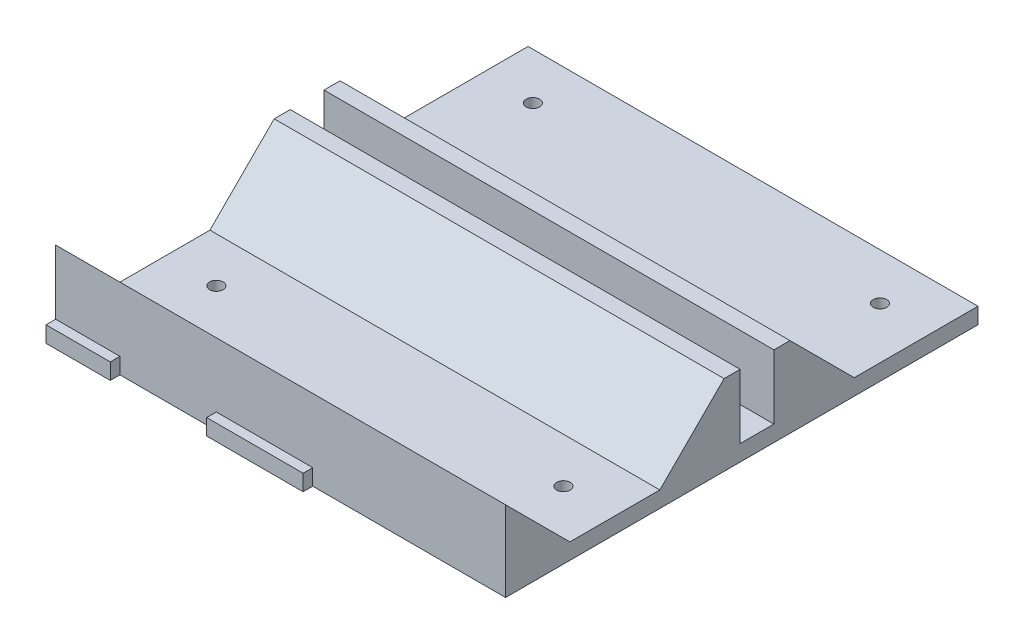
ISO-10303-21;
HEADER;
FILE_DESCRIPTION(('STEP AP214'),'2;1');
FILE_NAME('part.step','',(''),(''),'','','');
FILE_SCHEMA(('AUTOMOTIVE_DESIGN { 1 0 10303 214 1 1 1 1 }'));
ENDSEC;
DATA;
#1=APPLICATION_CONTEXT('core data for automotive mechanical design processes');
#2=APPLICATION_PROTOCOL_DEFINITION('international standard','automotive_design',2000,#1);
#3=PRODUCT_CONTEXT('',#1,'mechanical');
#4=PRODUCT('Part','Part','',(#3));
#5=PRODUCT_RELATED_PRODUCT_CATEGORY('part','',(#4));
#6=PRODUCT_DEFINITION_FORMATION('','',#4);
#7=PRODUCT_DEFINITION_CONTEXT('part definition',#1,'design');
#8=PRODUCT_DEFINITION('design','',#6,#7);
#9=PRODUCT_DEFINITION_SHAPE('','',#8);
#10=(LENGTH_UNIT() NAMED_UNIT(*) SI_UNIT(.MILLI.,.METRE.));
#11=(NAMED_UNIT(*) PLANE_ANGLE_UNIT() SI_UNIT($,.RADIAN.));
#12=(NAMED_UNIT(*) SI_UNIT($,.STERADIAN.) SOLID_ANGLE_UNIT());
#13=UNCERTAINTY_MEASURE_WITH_UNIT(LENGTH_MEASURE(1.E-05),#10,'distance_accuracy_value','');
#14=(GEOMETRIC_REPRESENTATION_CONTEXT(3) GLOBAL_UNCERTAINTY_ASSIGNED_CONTEXT((#13)) GLOBAL_UNIT_ASSIGNED_CONTEXT((#10,
#11,#12)) REPRESENTATION_CONTEXT('',''));
#15=CARTESIAN_POINT('',(0.,0.,0.));
#16=DIRECTION('',(0.,0.,1.));
#17=DIRECTION('',(1.,0.,0.));
#18=AXIS2_PLACEMENT_3D('',#15,#16,#17);
#19=CARTESIAN_POINT('',(150.,205.01,0.));
#20=DIRECTION('',(0.,0.,1.));
#21=DIRECTION('',(1.,0.,0.));
#22=AXIS2_PLACEMENT_3D('',#19,#20,#21);
#23=PLANE('',#22);
#24=DIRECTION('',(1.,0.,0.));
#25=VECTOR('',#24,1.);
#26=CARTESIAN_POINT('',(0.,5.,0.));
#27=LINE('',#26,#25);
#28=CARTESIAN_POINT('',(10.0000000000002,5.,0.));
#29=VERTEX_POINT('',#28);
#30=CARTESIAN_POINT('',(150.,5.,0.));
#31=VERTEX_POINT('',#30);
#32=EDGE_CURVE('E47',#29,#31,#27,.T.);
#33=ORIENTED_EDGE('',*,*,#32,.T.);
#34=DIRECTION('',(0.,-1.,0.));
#35=VECTOR('',#34,1.);
#36=CARTESIAN_POINT('',(150.,5.,0.));
#37=LINE('',#36,#35);
#38=CARTESIAN_POINT('',(150.,0.,0.));
#39=VERTEX_POINT('',#38);
#40=EDGE_CURVE('E333',#31,#39,#37,.T.);
#41=ORIENTED_EDGE('',*,*,#40,.T.);
#42=DIRECTION('',(1.,0.,0.));
#43=VECTOR('',#42,1.);
#44=CARTESIAN_POINT('',(0.,0.,0.));
#45=LINE('',#44,#43);
#46=CARTESIAN_POINT('',(10.0000000000002,0.,0.));
#47=VERTEX_POINT('',#46);
#48=EDGE_CURVE('E326',#47,#39,#45,.T.);
#49=ORIENTED_EDGE('',*,*,#48,.F.);
#50=DIRECTION('',(0.,1.,0.));
#51=VECTOR('',#50,1.);
#52=CARTESIAN_POINT('',(10.0000000000002,205.01,0.));
#53=LINE('',#52,#51);
#54=EDGE_CURVE('E11',#47,#29,#53,.T.);
#55=ORIENTED_EDGE('',*,*,#54,.T.);
#56=EDGE_LOOP('',(#33,#41,#49,#55));
#57=FACE_BOUND('',#56,.T.);
#58=ADVANCED_FACE('F44',(#57),#23,.F.);
#59=CARTESIAN_POINT('',(10.0000000000001,205.01,150.));
#60=DIRECTION('',(-1.,0.,0.));
#61=DIRECTION('',(0.,0.,1.));
#62=AXIS2_PLACEMENT_3D('',#59,#60,#61);
#63=PLANE('',#62);
#64=DIRECTION('',(0.,0.,1.));
#65=VECTOR('',#64,1.);
#66=CARTESIAN_POINT('',(10.0000000000002,5.,0.));
#67=LINE('',#66,#65);
#68=CARTESIAN_POINT('',(10.0000000000001,5.,38.4999999999998));
#69=VERTEX_POINT('',#68);
#70=EDGE_CURVE('E343',#29,#69,#67,.T.);
#71=ORIENTED_EDGE('',*,*,#70,.F.);
#72=ORIENTED_EDGE('',*,*,#54,.F.);
#73=DIRECTION('',(0.,0.,1.));
#74=VECTOR('',#73,1.);
#75=CARTESIAN_POINT('',(10.0000000000002,0.,0.));
#76=LINE('',#75,#74);
#77=CARTESIAN_POINT('',(10.0000000000001,0.,150.));
#78=VERTEX_POINT('',#77);
#79=EDGE_CURVE('E330',#47,#78,#76,.T.);
#80=ORIENTED_EDGE('',*,*,#79,.T.);
#81=DIRECTION('',(0.,1.,0.));
#82=VECTOR('',#81,1.);
#83=CARTESIAN_POINT('',(10.0000000000001,5.,150.));
#84=LINE('',#83,#82);
#85=CARTESIAN_POINT('',(10.0000000000001,5.,150.));
#86=VERTEX_POINT('',#85);
#87=EDGE_CURVE('E322',#78,#86,#84,.T.);
#88=ORIENTED_EDGE('',*,*,#87,.T.);
#89=DIRECTION('',(0.,0.,1.));
#90=VECTOR('',#89,1.);
#91=CARTESIAN_POINT('',(10.0000000000002,5.,0.));
#92=LINE('',#91,#90);
#93=CARTESIAN_POINT('',(10.0000000000001,5.,147.));
#94=VERTEX_POINT('',#93);
#95=EDGE_CURVE('E339',#94,#86,#92,.T.);
#96=ORIENTED_EDGE('',*,*,#95,.F.);
#97=DIRECTION('',(0.,-1.,0.));
#98=VECTOR('',#97,1.);
#99=CARTESIAN_POINT('',(10.0000000000001,5.,147.));
#100=LINE('',#99,#98);
#101=CARTESIAN_POINT('',(10.0000000000001,25.,147.));
#102=VERTEX_POINT('',#101);
#103=EDGE_CURVE('E337',#102,#94,#100,.T.);
#104=ORIENTED_EDGE('',*,*,#103,.F.);
#105=DIRECTION('',(0.,-0.707106781186552,-0.707106781186543));
#106=VECTOR('',#105,1.);
#107=CARTESIAN_POINT('',(10.0000000000001,5.00000000000015,127.000000000001));
#108=LINE('',#107,#106);
#109=CARTESIAN_POINT('',(10.0000000000001,5.,127.));
#110=VERTEX_POINT('',#109);
#111=EDGE_CURVE('E52',#102,#110,#108,.T.);
#112=ORIENTED_EDGE('',*,*,#111,.T.);
#113=DIRECTION('',(0.,0.,1.));
#114=VECTOR('',#113,1.);
#115=CARTESIAN_POINT('',(10.0000000000002,5.,0.));
#116=LINE('',#115,#114);
#117=CARTESIAN_POINT('',(10.0000000000002,5.,99.0000000000004));
#118=VERTEX_POINT('',#117);
#119=EDGE_CURVE('E344',#118,#110,#116,.T.);
#120=ORIENTED_EDGE('',*,*,#119,.F.);
#121=DIRECTION('',(0.,0.707106781186544,-0.707106781186551));
#122=VECTOR('',#121,1.);
#123=CARTESIAN_POINT('',(10.0000000000002,5.,99.0000000000004));
#124=LINE('',#123,#122);
#125=CARTESIAN_POINT('',(10.0000000000002,25.,79.0000000000002));
#126=VERTEX_POINT('',#125);
#127=EDGE_CURVE('E346',#118,#126,#124,.T.);
#128=ORIENTED_EDGE('',*,*,#127,.T.);
#129=DIRECTION('',(0.,0.,1.));
#130=VECTOR('',#129,1.);
#131=CARTESIAN_POINT('',(10.0000000000002,25.,0.));
#132=LINE('',#131,#130);
#133=CARTESIAN_POINT('',(10.0000000000002,25.,74.));
#134=VERTEX_POINT('',#133);
#135=EDGE_CURVE('E320',#134,#126,#132,.T.);
#136=ORIENTED_EDGE('',*,*,#135,.F.);
#137=DIRECTION('',(0.,1.,0.));
#138=VECTOR('',#137,1.);
#139=CARTESIAN_POINT('',(10.0000000000002,25.,74.));
#140=LINE('',#139,#138);
#141=CARTESIAN_POINT('',(10.0000000000002,5.,74.));
#142=VERTEX_POINT('',#141);
#143=EDGE_CURVE('E329',#142,#134,#140,.T.);
#144=ORIENTED_EDGE('',*,*,#143,.F.);
#145=DIRECTION('',(0.,0.,1.));
#146=VECTOR('',#145,1.);
#147=CARTESIAN_POINT('',(10.0000000000002,5.,0.));
#148=LINE('',#147,#146);
#149=CARTESIAN_POINT('',(10.0000000000002,5.,63.5));
#150=VERTEX_POINT('',#149);
#151=EDGE_CURVE('E328',#150,#142,#148,.T.);
#152=ORIENTED_EDGE('',*,*,#151,.F.);
#153=DIRECTION('',(0.,1.,0.));
#154=VECTOR('',#153,1.);
#155=CARTESIAN_POINT('',(10.0000000000002,25.,63.5));
#156=LINE('',#155,#154);
#157=CARTESIAN_POINT('',(10.0000000000002,25.,63.5));
#158=VERTEX_POINT('',#157);
#159=EDGE_CURVE('E325',#150,#158,#156,.T.);
#160=ORIENTED_EDGE('',*,*,#159,.T.);
#161=DIRECTION('',(0.,0.,1.));
#162=VECTOR('',#161,1.);
#163=CARTESIAN_POINT('',(10.0000000000002,25.,0.));
#164=LINE('',#163,#162);
#165=CARTESIAN_POINT('',(10.0000000000002,25.,58.4999999999996));
#166=VERTEX_POINT('',#165);
#167=EDGE_CURVE('E340',#166,#158,#164,.T.);
#168=ORIENTED_EDGE('',*,*,#167,.F.);
#169=DIRECTION('',(0.,0.707106781186551,0.707106781186544));
#170=VECTOR('',#169,1.);
#171=CARTESIAN_POINT('',(10.0000000000002,27.0000000000004,60.5));
#172=LINE('',#171,#170);
#173=EDGE_CURVE('E335',#166,#69,#172,.F.);
#174=ORIENTED_EDGE('',*,*,#173,.T.);
#175=EDGE_LOOP('',(#71,#72,#80,#88,#96,#104,#112,#120,#128,#136,#144,#152,#160,#168,#174));
#176=FACE_BOUND('',#175,.T.);
#177=ADVANCED_FACE('F369',(#176),#63,.T.);
#178=CARTESIAN_POINT('',(0.,5.,0.));
#179=DIRECTION('',(0.,1.,0.));
#180=DIRECTION('',(0.,0.,1.));
#181=AXIS2_PLACEMENT_3D('',#178,#179,#180);
#182=PLANE('',#181);
#183=CARTESIAN_POINT('',(26.0000000000002,5.,113.));
#184=DIRECTION('',(0.,1.,0.));
#185=DIRECTION('',(0.,0.,1.));
#186=AXIS2_PLACEMENT_3D('',#183,#184,#185);
#187=CIRCLE('',#186,2.1);
#188=CARTESIAN_POINT('',(26.0000000000002,5.,115.1));
#189=VERTEX_POINT('',#188);
#190=EDGE_CURVE('E420',#189,#189,#187,.T.);
#191=ORIENTED_EDGE('',*,*,#190,.F.);
#192=EDGE_LOOP('',(#191));
#193=FACE_BOUND('',#192,.T.);
#194=CARTESIAN_POINT('',(134.,5.,113.));
#195=DIRECTION('',(0.,1.,0.));
#196=DIRECTION('',(0.,0.,1.));
#197=AXIS2_PLACEMENT_3D('',#194,#195,#196);
#198=CIRCLE('',#197,2.09999999999999);
#199=CARTESIAN_POINT('',(134.,5.,115.1));
#200=VERTEX_POINT('',#199);
#201=EDGE_CURVE('E397',#200,#200,#198,.T.);
#202=ORIENTED_EDGE('',*,*,#201,.F.);
#203=EDGE_LOOP('',(#202));
#204=FACE_BOUND('',#203,.T.);
#205=DIRECTION('',(-1.,0.,0.));
#206=VECTOR('',#205,1.);
#207=CARTESIAN_POINT('',(0.,5.,99.0000000000004));
#208=LINE('',#207,#206);
#209=CARTESIAN_POINT('',(150.,5.,99.0000000000004));
#210=VERTEX_POINT('',#209);
#211=EDGE_CURVE('E304',#210,#118,#208,.T.);
#212=ORIENTED_EDGE('',*,*,#211,.T.);
#213=ORIENTED_EDGE('',*,*,#119,.T.);
#214=DIRECTION('',(-1.,0.,0.));
#215=VECTOR('',#214,1.);
#216=CARTESIAN_POINT('',(150.,5.,127.000000000001));
#217=LINE('',#216,#215);
#218=CARTESIAN_POINT('',(150.,5.,127.));
#219=VERTEX_POINT('',#218);
#220=EDGE_CURVE('E68',#219,#110,#217,.T.);
#221=ORIENTED_EDGE('',*,*,#220,.F.);
#222=DIRECTION('',(0.,0.,1.));
#223=VECTOR('',#222,1.);
#224=CARTESIAN_POINT('',(150.,5.,0.));
#225=LINE('',#224,#223);
#226=EDGE_CURVE('E197',#210,#219,#225,.T.);
#227=ORIENTED_EDGE('',*,*,#226,.F.);
#228=EDGE_LOOP('',(#212,#213,#221,#227));
#229=FACE_BOUND('',#228,.T.);
#230=ADVANCED_FACE('F441',(#193,#204,#229),#182,.T.);
#231=CARTESIAN_POINT('',(0.,5.,99.0000000000004));
#232=DIRECTION('',(0.,-0.707106781186551,-0.707106781186544));
#233=DIRECTION('',(-1.,0.,0.));
#234=AXIS2_PLACEMENT_3D('',#231,#232,#233);
#235=PLANE('',#234);
#236=ORIENTED_EDGE('',*,*,#127,.F.);
#237=ORIENTED_EDGE('',*,*,#211,.F.);
#238=DIRECTION('',(0.,-0.707106781186544,0.707106781186551));
#239=VECTOR('',#238,1.);
#240=CARTESIAN_POINT('',(150.,5.,99.0000000000004));
#241=LINE('',#240,#239);
#242=CARTESIAN_POINT('',(150.,25.,79.0000000000002));
#243=VERTEX_POINT('',#242);
#244=EDGE_CURVE('E317',#243,#210,#241,.T.);
#245=ORIENTED_EDGE('',*,*,#244,.F.);
#246=DIRECTION('',(1.,0.,0.));
#247=VECTOR('',#246,1.);
#248=CARTESIAN_POINT('',(0.,25.,79.0000000000002));
#249=LINE('',#248,#247);
#250=EDGE_CURVE('E314',#126,#243,#249,.T.);
#251=ORIENTED_EDGE('',*,*,#250,.F.);
#252=EDGE_LOOP('',(#236,#237,#245,#251));
#253=FACE_BOUND('',#252,.T.);
#254=ADVANCED_FACE('F444',(#253),#235,.F.);
#255=CARTESIAN_POINT('',(134.,5.,14.4999999999998));
#256=DIRECTION('',(0.,1.,0.));
#257=DIRECTION('',(0.,0.,1.));
#258=AXIS2_PLACEMENT_3D('',#255,#256,#257);
#259=CIRCLE('',#258,2.09999999999999);
#260=CARTESIAN_POINT('',(134.,5.,16.5999999999998));
#261=VERTEX_POINT('',#260);
#262=EDGE_CURVE('E405',#261,#261,#259,.T.);
#263=ORIENTED_EDGE('',*,*,#262,.F.);
#264=EDGE_LOOP('',(#263));
#265=FACE_BOUND('',#264,.T.);
#266=CARTESIAN_POINT('',(26.0000000000002,5.,14.4999999999998));
#267=DIRECTION('',(0.,1.,0.));
#268=DIRECTION('',(0.,0.,1.));
#269=AXIS2_PLACEMENT_3D('',#266,#267,#268);
#270=CIRCLE('',#269,2.1);
#271=CARTESIAN_POINT('',(26.0000000000002,5.,16.5999999999998));
#272=VERTEX_POINT('',#271);
#273=EDGE_CURVE('E412',#272,#272,#270,.T.);
#274=ORIENTED_EDGE('',*,*,#273,.F.);
#275=EDGE_LOOP('',(#274));
#276=FACE_BOUND('',#275,.T.);
#277=ORIENTED_EDGE('',*,*,#32,.F.);
#278=ORIENTED_EDGE('',*,*,#70,.T.);
#279=DIRECTION('',(1.,0.,0.));
#280=VECTOR('',#279,1.);
#281=CARTESIAN_POINT('',(150.,5.,38.4999999999998));
#282=LINE('',#281,#280);
#283=CARTESIAN_POINT('',(150.,5.,38.4999999999998));
#284=VERTEX_POINT('',#283);
#285=EDGE_CURVE('E190',#69,#284,#282,.T.);
#286=ORIENTED_EDGE('',*,*,#285,.T.);
#287=EDGE_CURVE('E191',#31,#284,#225,.T.);
#288=ORIENTED_EDGE('',*,*,#287,.F.);
#289=EDGE_LOOP('',(#277,#278,#286,#288));
#290=FACE_BOUND('',#289,.T.);
#291=ADVANCED_FACE('F363',(#265,#276,#290),#182,.T.);
#292=DIRECTION('',(-1.,0.,0.));
#293=VECTOR('',#292,1.);
#294=CARTESIAN_POINT('',(150.,5.,147.000000000001));
#295=LINE('',#294,#293);
#296=CARTESIAN_POINT('',(30.,5.,147.));
#297=VERTEX_POINT('',#296);
#298=EDGE_CURVE('E212',#297,#94,#295,.T.);
#299=ORIENTED_EDGE('',*,*,#298,.T.);
#300=ORIENTED_EDGE('',*,*,#95,.T.);
#301=DIRECTION('',(1.,0.,0.));
#302=VECTOR('',#301,1.);
#303=CARTESIAN_POINT('',(0.,5.,150.));
#304=LINE('',#303,#302);
#305=CARTESIAN_POINT('',(30.,5.,150.));
#306=VERTEX_POINT('',#305);
#307=EDGE_CURVE('E245',#86,#306,#304,.T.);
#308=ORIENTED_EDGE('',*,*,#307,.T.);
#309=DIRECTION('',(0.,0.,-1.));
#310=VECTOR('',#309,1.);
#311=CARTESIAN_POINT('',(30.,5.,150.));
#312=LINE('',#311,#310);
#313=EDGE_CURVE('E248',#306,#297,#312,.T.);
#314=ORIENTED_EDGE('',*,*,#313,.T.);
#315=EDGE_LOOP('',(#299,#300,#308,#314));
#316=FACE_BOUND('',#315,.T.);
#317=ADVANCED_FACE('F386',(#316),#182,.T.);
#318=CARTESIAN_POINT('',(0.,5.,147.));
#319=DIRECTION('',(0.,0.,1.));
#320=DIRECTION('',(1.,0.,0.));
#321=AXIS2_PLACEMENT_3D('',#318,#319,#320);
#322=PLANE('',#321);
#323=DIRECTION('',(-1.,0.,0.));
#324=VECTOR('',#323,1.);
#325=CARTESIAN_POINT('',(150.,25.,147.000000000001));
#326=LINE('',#325,#324);
#327=CARTESIAN_POINT('',(150.,25.,147.000000000001));
#328=VERTEX_POINT('',#327);
#329=EDGE_CURVE('E60',#328,#102,#326,.T.);
#330=ORIENTED_EDGE('',*,*,#329,.T.);
#331=ORIENTED_EDGE('',*,*,#103,.T.);
#332=ORIENTED_EDGE('',*,*,#298,.F.);
#333=DIRECTION('',(0.,-1.,0.));
#334=VECTOR('',#333,1.);
#335=CARTESIAN_POINT('',(30.,5.,147.));
#336=LINE('',#335,#334);
#337=CARTESIAN_POINT('',(30.,0.,147.));
#338=VERTEX_POINT('',#337);
#339=EDGE_CURVE('E252',#297,#338,#336,.T.);
#340=ORIENTED_EDGE('',*,*,#339,.T.);
#341=DIRECTION('',(-1.,0.,0.));
#342=VECTOR('',#341,1.);
#343=CARTESIAN_POINT('',(0.,0.,147.));
#344=LINE('',#343,#342);
#345=CARTESIAN_POINT('',(60.,0.,147.));
#346=VERTEX_POINT('',#345);
#347=EDGE_CURVE('E292',#346,#338,#344,.T.);
#348=ORIENTED_EDGE('',*,*,#347,.F.);
#349=DIRECTION('',(0.,-1.,0.));
#350=VECTOR('',#349,1.);
#351=CARTESIAN_POINT('',(60.,5.,147.));
#352=LINE('',#351,#350);
#353=CARTESIAN_POINT('',(60.,5.,147.));
#354=VERTEX_POINT('',#353);
#355=EDGE_CURVE('E241',#354,#346,#352,.T.);
#356=ORIENTED_EDGE('',*,*,#355,.F.);
#357=CARTESIAN_POINT('',(90.,5.,147.));
#358=VERTEX_POINT('',#357);
#359=EDGE_CURVE('E205',#358,#354,#295,.T.);
#360=ORIENTED_EDGE('',*,*,#359,.F.);
#361=DIRECTION('',(0.,-1.,0.));
#362=VECTOR('',#361,1.);
#363=CARTESIAN_POINT('',(90.,5.,147.));
#364=LINE('',#363,#362);
#365=CARTESIAN_POINT('',(90.,0.,147.));
#366=VERTEX_POINT('',#365);
#367=EDGE_CURVE('E225',#358,#366,#364,.T.);
#368=ORIENTED_EDGE('',*,*,#367,.T.);
#369=CARTESIAN_POINT('',(150.,0.,147.));
#370=VERTEX_POINT('',#369);
#371=EDGE_CURVE('E186',#370,#366,#344,.T.);
#372=ORIENTED_EDGE('',*,*,#371,.F.);
#373=DIRECTION('',(0.,-1.,0.));
#374=VECTOR('',#373,1.);
#375=CARTESIAN_POINT('',(150.,5.,147.));
#376=LINE('',#375,#374);
#377=EDGE_CURVE('E181',#328,#370,#376,.T.);
#378=ORIENTED_EDGE('',*,*,#377,.F.);
#379=EDGE_LOOP('',(#330,#331,#332,#340,#348,#356,#360,#368,#372,#378));
#380=FACE_BOUND('',#379,.T.);
#381=ADVANCED_FACE('F183',(#380),#322,.T.);
#382=CARTESIAN_POINT('',(0.,25.,0.));
#383=DIRECTION('',(0.,1.,0.));
#384=DIRECTION('',(0.,0.,1.));
#385=AXIS2_PLACEMENT_3D('',#382,#383,#384);
#386=PLANE('',#385);
#387=DIRECTION('',(1.,0.,0.));
#388=VECTOR('',#387,1.);
#389=CARTESIAN_POINT('',(0.,25.,58.4999999999996));
#390=LINE('',#389,#388);
#391=CARTESIAN_POINT('',(150.,25.,58.4999999999996));
#392=VERTEX_POINT('',#391);
#393=EDGE_CURVE('E307',#392,#166,#390,.F.);
#394=ORIENTED_EDGE('',*,*,#393,.T.);
#395=ORIENTED_EDGE('',*,*,#167,.T.);
#396=DIRECTION('',(1.,0.,0.));
#397=VECTOR('',#396,1.);
#398=CARTESIAN_POINT('',(0.,25.,63.5));
#399=LINE('',#398,#397);
#400=CARTESIAN_POINT('',(150.,25.,63.5));
#401=VERTEX_POINT('',#400);
#402=EDGE_CURVE('E279',#158,#401,#399,.T.);
#403=ORIENTED_EDGE('',*,*,#402,.T.);
#404=DIRECTION('',(0.,0.,1.));
#405=VECTOR('',#404,1.);
#406=CARTESIAN_POINT('',(150.,25.,0.));
#407=LINE('',#406,#405);
#408=EDGE_CURVE('E282',#392,#401,#407,.T.);
#409=ORIENTED_EDGE('',*,*,#408,.F.);
#410=EDGE_LOOP('',(#394,#395,#403,#409));
#411=FACE_BOUND('',#410,.T.);
#412=ADVANCED_FACE('F473',(#411),#386,.T.);
#413=CARTESIAN_POINT('',(0.,27.0000000000004,60.5));
#414=DIRECTION('',(0.,0.707106781186544,-0.707106781186551));
#415=DIRECTION('',(1.,0.,0.));
#416=AXIS2_PLACEMENT_3D('',#413,#414,#415);
#417=PLANE('',#416);
#418=ORIENTED_EDGE('',*,*,#173,.F.);
#419=ORIENTED_EDGE('',*,*,#393,.F.);
#420=DIRECTION('',(0.,-0.707106781186551,-0.707106781186544));
#421=VECTOR('',#420,1.);
#422=CARTESIAN_POINT('',(150.,27.0000000000004,60.5));
#423=LINE('',#422,#421);
#424=EDGE_CURVE('E310',#284,#392,#423,.F.);
#425=ORIENTED_EDGE('',*,*,#424,.F.);
#426=ORIENTED_EDGE('',*,*,#285,.F.);
#427=EDGE_LOOP('',(#418,#419,#425,#426));
#428=FACE_BOUND('',#427,.T.);
#429=ADVANCED_FACE('F372',(#428),#417,.T.);
#430=DIRECTION('',(-1.,0.,0.));
#431=VECTOR('',#430,1.);
#432=CARTESIAN_POINT('',(0.,5.,63.5));
#433=LINE('',#432,#431);
#434=CARTESIAN_POINT('',(150.,5.,63.5));
#435=VERTEX_POINT('',#434);
#436=EDGE_CURVE('E289',#435,#150,#433,.T.);
#437=ORIENTED_EDGE('',*,*,#436,.T.);
#438=ORIENTED_EDGE('',*,*,#151,.T.);
#439=DIRECTION('',(-1.,0.,0.));
#440=VECTOR('',#439,1.);
#441=CARTESIAN_POINT('',(0.,5.,74.));
#442=LINE('',#441,#440);
#443=CARTESIAN_POINT('',(150.,5.,74.));
#444=VERTEX_POINT('',#443);
#445=EDGE_CURVE('E275',#444,#142,#442,.T.);
#446=ORIENTED_EDGE('',*,*,#445,.F.);
#447=EDGE_CURVE('E296',#435,#444,#225,.T.);
#448=ORIENTED_EDGE('',*,*,#447,.F.);
#449=EDGE_LOOP('',(#437,#438,#446,#448));
#450=FACE_BOUND('',#449,.T.);
#451=ADVANCED_FACE('F465',(#450),#182,.T.);
#452=CARTESIAN_POINT('',(0.,0.,0.));
#453=DIRECTION('',(0.,1.,0.));
#454=DIRECTION('',(0.,0.,1.));
#455=AXIS2_PLACEMENT_3D('',#452,#453,#454);
#456=PLANE('',#455);
#457=CARTESIAN_POINT('',(26.0000000000002,0.,14.4999999999998));
#458=DIRECTION('',(0.,1.,0.));
#459=DIRECTION('',(0.,0.,1.));
#460=AXIS2_PLACEMENT_3D('',#457,#458,#459);
#461=CIRCLE('',#460,2.1);
#462=CARTESIAN_POINT('',(26.0000000000002,0.,16.5999999999998));
#463=VERTEX_POINT('',#462);
#464=EDGE_CURVE('E401',#463,#463,#461,.T.);
#465=ORIENTED_EDGE('',*,*,#464,.T.);
#466=EDGE_LOOP('',(#465));
#467=FACE_BOUND('',#466,.T.);
#468=CARTESIAN_POINT('',(26.0000000000002,0.,113.));
#469=DIRECTION('',(0.,1.,0.));
#470=DIRECTION('',(0.,0.,1.));
#471=AXIS2_PLACEMENT_3D('',#468,#469,#470);
#472=CIRCLE('',#471,2.1);
#473=CARTESIAN_POINT('',(26.0000000000002,0.,115.1));
#474=VERTEX_POINT('',#473);
#475=EDGE_CURVE('E416',#474,#474,#472,.T.);
#476=ORIENTED_EDGE('',*,*,#475,.T.);
#477=EDGE_LOOP('',(#476));
#478=FACE_BOUND('',#477,.T.);
#479=CARTESIAN_POINT('',(134.,0.,14.4999999999998));
#480=DIRECTION('',(0.,1.,0.));
#481=DIRECTION('',(0.,0.,1.));
#482=AXIS2_PLACEMENT_3D('',#479,#480,#481);
#483=CIRCLE('',#482,2.09999999999999);
#484=CARTESIAN_POINT('',(134.,0.,16.5999999999998));
#485=VERTEX_POINT('',#484);
#486=EDGE_CURVE('E199',#485,#485,#483,.T.);
#487=ORIENTED_EDGE('',*,*,#486,.T.);
#488=EDGE_LOOP('',(#487));
#489=FACE_BOUND('',#488,.T.);
#490=CARTESIAN_POINT('',(134.,0.,113.));
#491=DIRECTION('',(0.,1.,0.));
#492=DIRECTION('',(0.,0.,1.));
#493=AXIS2_PLACEMENT_3D('',#490,#491,#492);
#494=CIRCLE('',#493,2.09999999999999);
#495=CARTESIAN_POINT('',(134.,0.,115.1));
#496=VERTEX_POINT('',#495);
#497=EDGE_CURVE('E400',#496,#496,#494,.T.);
#498=ORIENTED_EDGE('',*,*,#497,.T.);
#499=EDGE_LOOP('',(#498));
#500=FACE_BOUND('',#499,.T.);
#501=ORIENTED_EDGE('',*,*,#79,.F.);
#502=ORIENTED_EDGE('',*,*,#48,.T.);
#503=DIRECTION('',(0.,0.,1.));
#504=VECTOR('',#503,1.);
#505=CARTESIAN_POINT('',(150.,0.,0.));
#506=LINE('',#505,#504);
#507=EDGE_CURVE('E299',#39,#370,#506,.T.);
#508=ORIENTED_EDGE('',*,*,#507,.T.);
#509=ORIENTED_EDGE('',*,*,#371,.T.);
#510=DIRECTION('',(0.,0.,-1.));
#511=VECTOR('',#510,1.);
#512=CARTESIAN_POINT('',(90.,0.,150.));
#513=LINE('',#512,#511);
#514=CARTESIAN_POINT('',(90.,0.,150.));
#515=VERTEX_POINT('',#514);
#516=EDGE_CURVE('E220',#515,#366,#513,.T.);
#517=ORIENTED_EDGE('',*,*,#516,.F.);
#518=DIRECTION('',(1.,0.,0.));
#519=VECTOR('',#518,1.);
#520=CARTESIAN_POINT('',(60.,0.,150.));
#521=LINE('',#520,#519);
#522=CARTESIAN_POINT('',(60.,0.,150.));
#523=VERTEX_POINT('',#522);
#524=EDGE_CURVE('E209',#523,#515,#521,.T.);
#525=ORIENTED_EDGE('',*,*,#524,.F.);
#526=DIRECTION('',(0.,0.,1.));
#527=VECTOR('',#526,1.);
#528=CARTESIAN_POINT('',(60.,0.,147.));
#529=LINE('',#528,#527);
#530=EDGE_CURVE('E204',#346,#523,#529,.T.);
#531=ORIENTED_EDGE('',*,*,#530,.F.);
#532=ORIENTED_EDGE('',*,*,#347,.T.);
#533=DIRECTION('',(0.,0.,-1.));
#534=VECTOR('',#533,1.);
#535=CARTESIAN_POINT('',(30.,0.,150.));
#536=LINE('',#535,#534);
#537=CARTESIAN_POINT('',(30.,0.,150.));
#538=VERTEX_POINT('',#537);
#539=EDGE_CURVE('E249',#538,#338,#536,.T.);
#540=ORIENTED_EDGE('',*,*,#539,.F.);
#541=DIRECTION('',(1.,0.,0.));
#542=VECTOR('',#541,1.);
#543=CARTESIAN_POINT('',(0.,0.,150.));
#544=LINE('',#543,#542);
#545=EDGE_CURVE('E244',#78,#538,#544,.T.);
#546=ORIENTED_EDGE('',*,*,#545,.F.);
#547=EDGE_LOOP('',(#501,#502,#508,#509,#517,#525,#531,#532,#540,#546));
#548=FACE_BOUND('',#547,.T.);
#549=ADVANCED_FACE('F430',(#467,#478,#489,#500,#548),#456,.F.);
#550=CARTESIAN_POINT('',(0.,25.,63.5));
#551=DIRECTION('',(0.,0.,-1.));
#552=DIRECTION('',(-1.,0.,0.));
#553=AXIS2_PLACEMENT_3D('',#550,#551,#552);
#554=PLANE('',#553);
#555=ORIENTED_EDGE('',*,*,#159,.F.);
#556=ORIENTED_EDGE('',*,*,#436,.F.);
#557=DIRECTION('',(0.,-1.,0.));
#558=VECTOR('',#557,1.);
#559=CARTESIAN_POINT('',(150.,25.,63.5));
#560=LINE('',#559,#558);
#561=EDGE_CURVE('E286',#401,#435,#560,.T.);
#562=ORIENTED_EDGE('',*,*,#561,.F.);
#563=ORIENTED_EDGE('',*,*,#402,.F.);
#564=EDGE_LOOP('',(#555,#556,#562,#563));
#565=FACE_BOUND('',#564,.T.);
#566=ADVANCED_FACE('F470',(#565),#554,.F.);
#567=CARTESIAN_POINT('',(0.,25.,74.));
#568=DIRECTION('',(0.,0.,-1.));
#569=DIRECTION('',(-1.,0.,0.));
#570=AXIS2_PLACEMENT_3D('',#567,#568,#569);
#571=PLANE('',#570);
#572=ORIENTED_EDGE('',*,*,#445,.T.);
#573=ORIENTED_EDGE('',*,*,#143,.T.);
#574=DIRECTION('',(1.,0.,0.));
#575=VECTOR('',#574,1.);
#576=CARTESIAN_POINT('',(0.,25.,74.));
#577=LINE('',#576,#575);
#578=CARTESIAN_POINT('',(150.,25.,74.));
#579=VERTEX_POINT('',#578);
#580=EDGE_CURVE('E269',#134,#579,#577,.T.);
#581=ORIENTED_EDGE('',*,*,#580,.T.);
#582=DIRECTION('',(0.,-1.,0.));
#583=VECTOR('',#582,1.);
#584=CARTESIAN_POINT('',(150.,25.,74.));
#585=LINE('',#584,#583);
#586=EDGE_CURVE('E272',#579,#444,#585,.T.);
#587=ORIENTED_EDGE('',*,*,#586,.T.);
#588=EDGE_LOOP('',(#572,#573,#581,#587));
#589=FACE_BOUND('',#588,.T.);
#590=ADVANCED_FACE('F463',(#589),#571,.T.);
#591=CARTESIAN_POINT('',(0.,25.,0.));
#592=DIRECTION('',(0.,1.,0.));
#593=DIRECTION('',(0.,0.,1.));
#594=AXIS2_PLACEMENT_3D('',#591,#592,#593);
#595=PLANE('',#594);
#596=ORIENTED_EDGE('',*,*,#580,.F.);
#597=ORIENTED_EDGE('',*,*,#135,.T.);
#598=ORIENTED_EDGE('',*,*,#250,.T.);
#599=DIRECTION('',(0.,0.,1.));
#600=VECTOR('',#599,1.);
#601=CARTESIAN_POINT('',(150.,25.,0.));
#602=LINE('',#601,#600);
#603=EDGE_CURVE('E265',#579,#243,#602,.T.);
#604=ORIENTED_EDGE('',*,*,#603,.F.);
#605=EDGE_LOOP('',(#596,#597,#598,#604));
#606=FACE_BOUND('',#605,.T.);
#607=ADVANCED_FACE('F457',(#606),#595,.T.);
#608=CARTESIAN_POINT('',(0.,5.,150.));
#609=DIRECTION('',(0.,0.,-1.));
#610=DIRECTION('',(-1.,0.,0.));
#611=AXIS2_PLACEMENT_3D('',#608,#609,#610);
#612=PLANE('',#611);
#613=ORIENTED_EDGE('',*,*,#87,.F.);
#614=ORIENTED_EDGE('',*,*,#545,.T.);
#615=DIRECTION('',(0.,-1.,0.));
#616=VECTOR('',#615,1.);
#617=CARTESIAN_POINT('',(30.,5.,150.));
#618=LINE('',#617,#616);
#619=EDGE_CURVE('E261',#306,#538,#618,.T.);
#620=ORIENTED_EDGE('',*,*,#619,.F.);
#621=ORIENTED_EDGE('',*,*,#307,.F.);
#622=EDGE_LOOP('',(#613,#614,#620,#621));
#623=FACE_BOUND('',#622,.T.);
#624=ADVANCED_FACE('F381',(#623),#612,.F.);
#625=CARTESIAN_POINT('',(150.,5.,127.000000000001));
#626=DIRECTION('',(0.,-0.707106781186543,0.707106781186552));
#627=DIRECTION('',(0.,-0.707106781186552,-0.707106781186543));
#628=AXIS2_PLACEMENT_3D('',#625,#626,#627);
#629=PLANE('',#628);
#630=ORIENTED_EDGE('',*,*,#111,.F.);
#631=ORIENTED_EDGE('',*,*,#329,.F.);
#632=DIRECTION('',(0.,0.707106781186552,0.707106781186543));
#633=VECTOR('',#632,1.);
#634=CARTESIAN_POINT('',(150.,5.,127.000000000001));
#635=LINE('',#634,#633);
#636=EDGE_CURVE('E194',#219,#328,#635,.T.);
#637=ORIENTED_EDGE('',*,*,#636,.F.);
#638=ORIENTED_EDGE('',*,*,#220,.T.);
#639=EDGE_LOOP('',(#630,#631,#637,#638));
#640=FACE_BOUND('',#639,.T.);
#641=ADVANCED_FACE('F201',(#640),#629,.F.);
#642=DIRECTION('',(0.,0.,-1.));
#643=VECTOR('',#642,1.);
#644=CARTESIAN_POINT('',(90.,5.,150.));
#645=LINE('',#644,#643);
#646=CARTESIAN_POINT('',(90.,5.,150.));
#647=VERTEX_POINT('',#646);
#648=EDGE_CURVE('E223',#647,#358,#645,.T.);
#649=ORIENTED_EDGE('',*,*,#648,.T.);
#650=ORIENTED_EDGE('',*,*,#359,.T.);
#651=DIRECTION('',(0.,0.,1.));
#652=VECTOR('',#651,1.);
#653=CARTESIAN_POINT('',(60.,5.,147.));
#654=LINE('',#653,#652);
#655=CARTESIAN_POINT('',(60.,5.,150.));
#656=VERTEX_POINT('',#655);
#657=EDGE_CURVE('E216',#354,#656,#654,.T.);
#658=ORIENTED_EDGE('',*,*,#657,.T.);
#659=DIRECTION('',(1.,0.,0.));
#660=VECTOR('',#659,1.);
#661=CARTESIAN_POINT('',(60.,5.,150.));
#662=LINE('',#661,#660);
#663=EDGE_CURVE('E219',#656,#647,#662,.T.);
#664=ORIENTED_EDGE('',*,*,#663,.T.);
#665=EDGE_LOOP('',(#649,#650,#658,#664));
#666=FACE_BOUND('',#665,.T.);
#667=ADVANCED_FACE('F446',(#666),#182,.T.);
#668=CARTESIAN_POINT('',(150.,5.,0.));
#669=DIRECTION('',(1.,0.,0.));
#670=DIRECTION('',(0.,0.,-1.));
#671=AXIS2_PLACEMENT_3D('',#668,#669,#670);
#672=PLANE('',#671);
#673=ORIENTED_EDGE('',*,*,#40,.F.);
#674=ORIENTED_EDGE('',*,*,#287,.T.);
#675=ORIENTED_EDGE('',*,*,#424,.T.);
#676=ORIENTED_EDGE('',*,*,#408,.T.);
#677=ORIENTED_EDGE('',*,*,#561,.T.);
#678=ORIENTED_EDGE('',*,*,#447,.T.);
#679=ORIENTED_EDGE('',*,*,#586,.F.);
#680=ORIENTED_EDGE('',*,*,#603,.T.);
#681=ORIENTED_EDGE('',*,*,#244,.T.);
#682=ORIENTED_EDGE('',*,*,#226,.T.);
#683=ORIENTED_EDGE('',*,*,#636,.T.);
#684=ORIENTED_EDGE('',*,*,#377,.T.);
#685=ORIENTED_EDGE('',*,*,#507,.F.);
#686=EDGE_LOOP('',(#673,#674,#675,#676,#677,#678,#679,#680,#681,#682,#683,#684,#685));
#687=FACE_BOUND('',#686,.T.);
#688=ADVANCED_FACE('F195',(#687),#672,.T.);
#689=CARTESIAN_POINT('',(30.,5.,150.));
#690=DIRECTION('',(-1.,0.,0.));
#691=DIRECTION('',(0.,0.,1.));
#692=AXIS2_PLACEMENT_3D('',#689,#690,#691);
#693=PLANE('',#692);
#694=ORIENTED_EDGE('',*,*,#539,.T.);
#695=ORIENTED_EDGE('',*,*,#339,.F.);
#696=ORIENTED_EDGE('',*,*,#313,.F.);
#697=ORIENTED_EDGE('',*,*,#619,.T.);
#698=EDGE_LOOP('',(#694,#695,#696,#697));
#699=FACE_BOUND('',#698,.T.);
#700=ADVANCED_FACE('F519',(#699),#693,.F.);
#701=CARTESIAN_POINT('',(60.,5.,147.));
#702=DIRECTION('',(1.,0.,0.));
#703=DIRECTION('',(0.,0.,-1.));
#704=AXIS2_PLACEMENT_3D('',#701,#702,#703);
#705=PLANE('',#704);
#706=ORIENTED_EDGE('',*,*,#530,.T.);
#707=DIRECTION('',(0.,-1.,0.));
#708=VECTOR('',#707,1.);
#709=CARTESIAN_POINT('',(60.,5.,150.));
#710=LINE('',#709,#708);
#711=EDGE_CURVE('E237',#656,#523,#710,.T.);
#712=ORIENTED_EDGE('',*,*,#711,.F.);
#713=ORIENTED_EDGE('',*,*,#657,.F.);
#714=ORIENTED_EDGE('',*,*,#355,.T.);
#715=EDGE_LOOP('',(#706,#712,#713,#714));
#716=FACE_BOUND('',#715,.T.);
#717=ADVANCED_FACE('F515',(#716),#705,.F.);
#718=CARTESIAN_POINT('',(60.,5.,150.));
#719=DIRECTION('',(0.,0.,-1.));
#720=DIRECTION('',(-1.,0.,0.));
#721=AXIS2_PLACEMENT_3D('',#718,#719,#720);
#722=PLANE('',#721);
#723=ORIENTED_EDGE('',*,*,#524,.T.);
#724=DIRECTION('',(0.,-1.,0.));
#725=VECTOR('',#724,1.);
#726=CARTESIAN_POINT('',(90.,5.,150.));
#727=LINE('',#726,#725);
#728=EDGE_CURVE('E233',#647,#515,#727,.T.);
#729=ORIENTED_EDGE('',*,*,#728,.F.);
#730=ORIENTED_EDGE('',*,*,#663,.F.);
#731=ORIENTED_EDGE('',*,*,#711,.T.);
#732=EDGE_LOOP('',(#723,#729,#730,#731));
#733=FACE_BOUND('',#732,.T.);
#734=ADVANCED_FACE('F511',(#733),#722,.F.);
#735=CARTESIAN_POINT('',(90.,5.,150.));
#736=DIRECTION('',(-1.,0.,0.));
#737=DIRECTION('',(0.,0.,1.));
#738=AXIS2_PLACEMENT_3D('',#735,#736,#737);
#739=PLANE('',#738);
#740=ORIENTED_EDGE('',*,*,#516,.T.);
#741=ORIENTED_EDGE('',*,*,#367,.F.);
#742=ORIENTED_EDGE('',*,*,#648,.F.);
#743=ORIENTED_EDGE('',*,*,#728,.T.);
#744=EDGE_LOOP('',(#740,#741,#742,#743));
#745=FACE_BOUND('',#744,.T.);
#746=ADVANCED_FACE('F508',(#745),#739,.F.);
#747=CARTESIAN_POINT('',(26.0000000000002,0.,14.4999999999998));
#748=DIRECTION('',(0.,1.,0.));
#749=DIRECTION('',(0.,0.,1.));
#750=AXIS2_PLACEMENT_3D('',#747,#748,#749);
#751=CYLINDRICAL_SURFACE('',#750,2.1);
#752=ORIENTED_EDGE('',*,*,#464,.F.);
#753=EDGE_LOOP('',(#752));
#754=FACE_BOUND('',#753,.T.);
#755=ORIENTED_EDGE('',*,*,#273,.T.);
#756=EDGE_LOOP('',(#755));
#757=FACE_BOUND('',#756,.T.);
#758=ADVANCED_FACE('F437',(#754,#757),#751,.F.);
#759=CARTESIAN_POINT('',(26.0000000000002,0.,113.));
#760=DIRECTION('',(0.,1.,0.));
#761=DIRECTION('',(0.,0.,1.));
#762=AXIS2_PLACEMENT_3D('',#759,#760,#761);
#763=CYLINDRICAL_SURFACE('',#762,2.1);
#764=ORIENTED_EDGE('',*,*,#475,.F.);
#765=EDGE_LOOP('',(#764));
#766=FACE_BOUND('',#765,.T.);
#767=ORIENTED_EDGE('',*,*,#190,.T.);
#768=EDGE_LOOP('',(#767));
#769=FACE_BOUND('',#768,.T.);
#770=ADVANCED_FACE('F433',(#766,#769),#763,.F.);
#771=CARTESIAN_POINT('',(134.,0.,14.4999999999998));
#772=DIRECTION('',(0.,1.,0.));
#773=DIRECTION('',(0.,0.,1.));
#774=AXIS2_PLACEMENT_3D('',#771,#772,#773);
#775=CYLINDRICAL_SURFACE('',#774,2.09999999999999);
#776=ORIENTED_EDGE('',*,*,#486,.F.);
#777=EDGE_LOOP('',(#776));
#778=FACE_BOUND('',#777,.T.);
#779=ORIENTED_EDGE('',*,*,#262,.T.);
#780=EDGE_LOOP('',(#779));
#781=FACE_BOUND('',#780,.T.);
#782=ADVANCED_FACE('F436',(#778,#781),#775,.F.);
#783=CARTESIAN_POINT('',(134.,0.,113.));
#784=DIRECTION('',(0.,1.,0.));
#785=DIRECTION('',(0.,0.,1.));
#786=AXIS2_PLACEMENT_3D('',#783,#784,#785);
#787=CYLINDRICAL_SURFACE('',#786,2.09999999999999);
#788=ORIENTED_EDGE('',*,*,#497,.F.);
#789=EDGE_LOOP('',(#788));
#790=FACE_BOUND('',#789,.T.);
#791=ORIENTED_EDGE('',*,*,#201,.T.);
#792=EDGE_LOOP('',(#791));
#793=FACE_BOUND('',#792,.T.);
#794=ADVANCED_FACE('F489',(#790,#793),#787,.F.);
#795=CLOSED_SHELL('',(#58,#177,#230,#254,#291,#317,#381,#412,#429,#451,#549,#566,#590,#607,#624,
#641,#667,#688,#700,#717,#734,#746,#758,#770,#782,#794));
#796=MANIFOLD_SOLID_BREP('B2',#795);
#797=ADVANCED_BREP_SHAPE_REPRESENTATION('',(#18,#796),#14);
#798=SHAPE_DEFINITION_REPRESENTATION(#9,#797);
ENDSEC;
END-ISO-10303-21;
